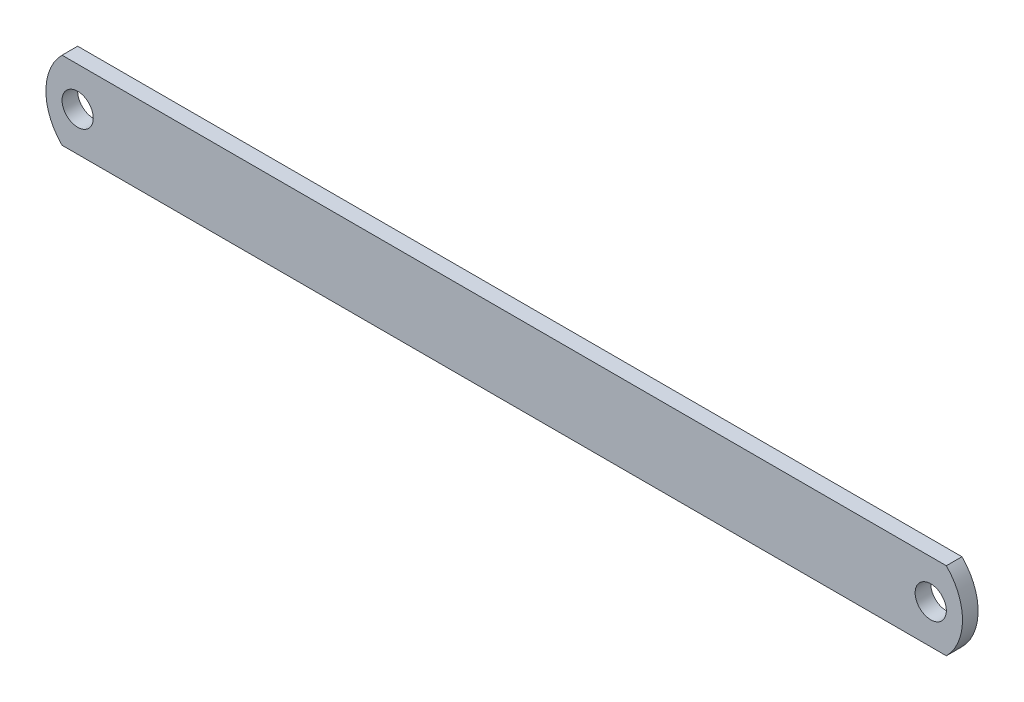
ISO-10303-21;
HEADER;
FILE_DESCRIPTION(('STEP AP214'),'2;1');
FILE_NAME('part.step','',(''),(''),'','','');
FILE_SCHEMA(('AUTOMOTIVE_DESIGN { 1 0 10303 214 1 1 1 1 }'));
ENDSEC;
DATA;
#1=APPLICATION_CONTEXT('core data for automotive mechanical design processes');
#2=APPLICATION_PROTOCOL_DEFINITION('international standard','automotive_design',2000,#1);
#3=PRODUCT_CONTEXT('',#1,'mechanical');
#4=PRODUCT('Part','Part','',(#3));
#5=PRODUCT_RELATED_PRODUCT_CATEGORY('part','',(#4));
#6=PRODUCT_DEFINITION_FORMATION('','',#4);
#7=PRODUCT_DEFINITION_CONTEXT('part definition',#1,'design');
#8=PRODUCT_DEFINITION('design','',#6,#7);
#9=PRODUCT_DEFINITION_SHAPE('','',#8);
#10=(LENGTH_UNIT() NAMED_UNIT(*) SI_UNIT(.MILLI.,.METRE.));
#11=(NAMED_UNIT(*) PLANE_ANGLE_UNIT() SI_UNIT($,.RADIAN.));
#12=(NAMED_UNIT(*) SI_UNIT($,.STERADIAN.) SOLID_ANGLE_UNIT());
#13=UNCERTAINTY_MEASURE_WITH_UNIT(LENGTH_MEASURE(1.E-05),#10,'distance_accuracy_value','');
#14=(GEOMETRIC_REPRESENTATION_CONTEXT(3) GLOBAL_UNCERTAINTY_ASSIGNED_CONTEXT((#13)) GLOBAL_UNIT_ASSIGNED_CONTEXT((#10,
#11,#12)) REPRESENTATION_CONTEXT('',''));
#15=CARTESIAN_POINT('',(0.,0.,0.));
#16=DIRECTION('',(0.,0.,1.));
#17=DIRECTION('',(1.,0.,0.));
#18=AXIS2_PLACEMENT_3D('',#15,#16,#17);
#19=CARTESIAN_POINT('',(7.50000000000006,-7.5,3.));
#20=DIRECTION('',(0.,0.,-1.));
#21=DIRECTION('',(-1.,0.,0.));
#22=AXIS2_PLACEMENT_3D('',#19,#20,#21);
#23=CYLINDRICAL_SURFACE('',#22,10.6066017177983);
#24=CARTESIAN_POINT('',(7.50000000000006,-7.5,0.));
#25=DIRECTION('',(0.,0.,1.));
#26=DIRECTION('',(1.,0.,0.));
#27=AXIS2_PLACEMENT_3D('',#24,#25,#26);
#28=CIRCLE('',#27,10.6066017177983);
#29=CARTESIAN_POINT('',(0.,0.,0.));
#30=VERTEX_POINT('',#29);
#31=CARTESIAN_POINT('',(0.,-15.,0.));
#32=VERTEX_POINT('',#31);
#33=EDGE_CURVE('E110',#30,#32,#28,.T.);
#34=ORIENTED_EDGE('',*,*,#33,.T.);
#35=DIRECTION('',(0.,0.,-1.));
#36=VECTOR('',#35,1.);
#37=CARTESIAN_POINT('',(0.,-15.,3.));
#38=LINE('',#37,#36);
#39=CARTESIAN_POINT('',(0.,-15.,3.));
#40=VERTEX_POINT('',#39);
#41=EDGE_CURVE('E13',#40,#32,#38,.T.);
#42=ORIENTED_EDGE('',*,*,#41,.F.);
#43=CARTESIAN_POINT('',(7.50000000000006,-7.5,3.));
#44=DIRECTION('',(0.,0.,1.));
#45=DIRECTION('',(1.,0.,0.));
#46=AXIS2_PLACEMENT_3D('',#43,#44,#45);
#47=CIRCLE('',#46,10.6066017177983);
#48=CARTESIAN_POINT('',(0.,0.,3.));
#49=VERTEX_POINT('',#48);
#50=EDGE_CURVE('E97',#49,#40,#47,.T.);
#51=ORIENTED_EDGE('',*,*,#50,.F.);
#52=DIRECTION('',(0.,0.,-1.));
#53=VECTOR('',#52,1.);
#54=CARTESIAN_POINT('',(0.,0.,3.));
#55=LINE('',#54,#53);
#56=EDGE_CURVE('E106',#49,#30,#55,.T.);
#57=ORIENTED_EDGE('',*,*,#56,.T.);
#58=EDGE_LOOP('',(#34,#42,#51,#57));
#59=FACE_BOUND('',#58,.T.);
#60=ADVANCED_FACE('F44',(#59),#23,.T.);
#61=CARTESIAN_POINT('',(0.,-15.,3.));
#62=DIRECTION('',(0.,1.,0.));
#63=DIRECTION('',(0.,0.,1.));
#64=AXIS2_PLACEMENT_3D('',#61,#62,#63);
#65=PLANE('',#64);
#66=DIRECTION('',(1.,0.,0.));
#67=VECTOR('',#66,1.);
#68=CARTESIAN_POINT('',(0.,-15.,0.));
#69=LINE('',#68,#67);
#70=CARTESIAN_POINT('',(170.,-15.,0.));
#71=VERTEX_POINT('',#70);
#72=EDGE_CURVE('E101',#32,#71,#69,.T.);
#73=ORIENTED_EDGE('',*,*,#72,.T.);
#74=DIRECTION('',(0.,0.,-1.));
#75=VECTOR('',#74,1.);
#76=CARTESIAN_POINT('',(170.,-15.,3.));
#77=LINE('',#76,#75);
#78=CARTESIAN_POINT('',(170.,-15.,3.));
#79=VERTEX_POINT('',#78);
#80=EDGE_CURVE('E53',#79,#71,#77,.T.);
#81=ORIENTED_EDGE('',*,*,#80,.F.);
#82=DIRECTION('',(1.,0.,0.));
#83=VECTOR('',#82,1.);
#84=CARTESIAN_POINT('',(0.,-15.,3.));
#85=LINE('',#84,#83);
#86=EDGE_CURVE('E92',#40,#79,#85,.T.);
#87=ORIENTED_EDGE('',*,*,#86,.F.);
#88=ORIENTED_EDGE('',*,*,#41,.T.);
#89=EDGE_LOOP('',(#73,#81,#87,#88));
#90=FACE_BOUND('',#89,.T.);
#91=ADVANCED_FACE('F100',(#90),#65,.F.);
#92=CARTESIAN_POINT('',(162.5,-7.5,3.));
#93=DIRECTION('',(0.,0.,-1.));
#94=DIRECTION('',(-1.,0.,0.));
#95=AXIS2_PLACEMENT_3D('',#92,#93,#94);
#96=CYLINDRICAL_SURFACE('',#95,10.6066017177983);
#97=CARTESIAN_POINT('',(162.5,-7.5,0.));
#98=DIRECTION('',(0.,0.,1.));
#99=DIRECTION('',(-1.,0.,0.));
#100=AXIS2_PLACEMENT_3D('',#97,#98,#99);
#101=CIRCLE('',#100,10.6066017177983);
#102=CARTESIAN_POINT('',(170.,0.,0.));
#103=VERTEX_POINT('',#102);
#104=EDGE_CURVE('E79',#71,#103,#101,.T.);
#105=ORIENTED_EDGE('',*,*,#104,.T.);
#106=DIRECTION('',(0.,0.,-1.));
#107=VECTOR('',#106,1.);
#108=CARTESIAN_POINT('',(170.,0.,3.));
#109=LINE('',#108,#107);
#110=CARTESIAN_POINT('',(170.,0.,3.));
#111=VERTEX_POINT('',#110);
#112=EDGE_CURVE('E102',#111,#103,#109,.T.);
#113=ORIENTED_EDGE('',*,*,#112,.F.);
#114=CARTESIAN_POINT('',(162.5,-7.5,3.));
#115=DIRECTION('',(0.,0.,1.));
#116=DIRECTION('',(-1.,0.,0.));
#117=AXIS2_PLACEMENT_3D('',#114,#115,#116);
#118=CIRCLE('',#117,10.6066017177983);
#119=EDGE_CURVE('E95',#79,#111,#118,.T.);
#120=ORIENTED_EDGE('',*,*,#119,.F.);
#121=ORIENTED_EDGE('',*,*,#80,.T.);
#122=EDGE_LOOP('',(#105,#113,#120,#121));
#123=FACE_BOUND('',#122,.T.);
#124=ADVANCED_FACE('F104',(#123),#96,.T.);
#125=CARTESIAN_POINT('',(0.,0.,3.));
#126=DIRECTION('',(0.,-1.,0.));
#127=DIRECTION('',(0.,0.,-1.));
#128=AXIS2_PLACEMENT_3D('',#125,#126,#127);
#129=PLANE('',#128);
#130=DIRECTION('',(-1.,0.,0.));
#131=VECTOR('',#130,1.);
#132=CARTESIAN_POINT('',(0.,0.,0.));
#133=LINE('',#132,#131);
#134=EDGE_CURVE('E85',#103,#30,#133,.T.);
#135=ORIENTED_EDGE('',*,*,#134,.T.);
#136=ORIENTED_EDGE('',*,*,#56,.F.);
#137=DIRECTION('',(-1.,0.,0.));
#138=VECTOR('',#137,1.);
#139=CARTESIAN_POINT('',(0.,0.,3.));
#140=LINE('',#139,#138);
#141=EDGE_CURVE('E62',#111,#49,#140,.T.);
#142=ORIENTED_EDGE('',*,*,#141,.F.);
#143=ORIENTED_EDGE('',*,*,#112,.T.);
#144=EDGE_LOOP('',(#135,#136,#142,#143));
#145=FACE_BOUND('',#144,.T.);
#146=ADVANCED_FACE('F138',(#145),#129,.F.);
#147=CARTESIAN_POINT('',(7.50000000000006,-7.5,3.));
#148=DIRECTION('',(0.,0.,1.));
#149=DIRECTION('',(1.,0.,0.));
#150=AXIS2_PLACEMENT_3D('',#147,#148,#149);
#151=PLANE('',#150);
#152=CARTESIAN_POINT('',(167.,-7.5,3.));
#153=DIRECTION('',(0.,0.,1.));
#154=DIRECTION('',(1.,0.,0.));
#155=AXIS2_PLACEMENT_3D('',#152,#153,#154);
#156=CIRCLE('',#155,2.99999999999999);
#157=CARTESIAN_POINT('',(170.,-7.5,3.));
#158=VERTEX_POINT('',#157);
#159=EDGE_CURVE('E127',#158,#158,#156,.T.);
#160=ORIENTED_EDGE('',*,*,#159,.F.);
#161=EDGE_LOOP('',(#160));
#162=FACE_BOUND('',#161,.T.);
#163=CARTESIAN_POINT('',(3.,-7.5,3.));
#164=DIRECTION('',(0.,0.,1.));
#165=DIRECTION('',(1.,0.,0.));
#166=AXIS2_PLACEMENT_3D('',#163,#164,#165);
#167=CIRCLE('',#166,3.);
#168=CARTESIAN_POINT('',(6.,-7.5,3.));
#169=VERTEX_POINT('',#168);
#170=EDGE_CURVE('E119',#169,#169,#167,.T.);
#171=ORIENTED_EDGE('',*,*,#170,.F.);
#172=EDGE_LOOP('',(#171));
#173=FACE_BOUND('',#172,.T.);
#174=ORIENTED_EDGE('',*,*,#50,.T.);
#175=ORIENTED_EDGE('',*,*,#86,.T.);
#176=ORIENTED_EDGE('',*,*,#119,.T.);
#177=ORIENTED_EDGE('',*,*,#141,.T.);
#178=EDGE_LOOP('',(#174,#175,#176,#177));
#179=FACE_BOUND('',#178,.T.);
#180=ADVANCED_FACE('F93',(#162,#173,#179),#151,.T.);
#181=CARTESIAN_POINT('',(7.50000000000006,-7.5,0.));
#182=DIRECTION('',(0.,0.,1.));
#183=DIRECTION('',(1.,0.,0.));
#184=AXIS2_PLACEMENT_3D('',#181,#182,#183);
#185=PLANE('',#184);
#186=CARTESIAN_POINT('',(167.,-7.5,0.));
#187=DIRECTION('',(0.,0.,1.));
#188=DIRECTION('',(1.,0.,0.));
#189=AXIS2_PLACEMENT_3D('',#186,#187,#188);
#190=CIRCLE('',#189,2.99999999999999);
#191=CARTESIAN_POINT('',(170.,-7.5,0.));
#192=VERTEX_POINT('',#191);
#193=EDGE_CURVE('E47',#192,#192,#190,.T.);
#194=ORIENTED_EDGE('',*,*,#193,.T.);
#195=EDGE_LOOP('',(#194));
#196=FACE_BOUND('',#195,.T.);
#197=CARTESIAN_POINT('',(3.,-7.5,0.));
#198=DIRECTION('',(0.,0.,1.));
#199=DIRECTION('',(1.,0.,0.));
#200=AXIS2_PLACEMENT_3D('',#197,#198,#199);
#201=CIRCLE('',#200,3.);
#202=CARTESIAN_POINT('',(6.,-7.5,0.));
#203=VERTEX_POINT('',#202);
#204=EDGE_CURVE('E113',#203,#203,#201,.T.);
#205=ORIENTED_EDGE('',*,*,#204,.T.);
#206=EDGE_LOOP('',(#205));
#207=FACE_BOUND('',#206,.T.);
#208=ORIENTED_EDGE('',*,*,#33,.F.);
#209=ORIENTED_EDGE('',*,*,#134,.F.);
#210=ORIENTED_EDGE('',*,*,#104,.F.);
#211=ORIENTED_EDGE('',*,*,#72,.F.);
#212=EDGE_LOOP('',(#208,#209,#210,#211));
#213=FACE_BOUND('',#212,.T.);
#214=ADVANCED_FACE('F137',(#196,#207,#213),#185,.F.);
#215=CARTESIAN_POINT('',(3.,-7.5,-7.));
#216=DIRECTION('',(0.,0.,1.));
#217=DIRECTION('',(1.,0.,0.));
#218=AXIS2_PLACEMENT_3D('',#215,#216,#217);
#219=CYLINDRICAL_SURFACE('',#218,3.);
#220=ORIENTED_EDGE('',*,*,#170,.T.);
#221=EDGE_LOOP('',(#220));
#222=FACE_BOUND('',#221,.T.);
#223=ORIENTED_EDGE('',*,*,#204,.F.);
#224=EDGE_LOOP('',(#223));
#225=FACE_BOUND('',#224,.T.);
#226=ADVANCED_FACE('F144',(#222,#225),#219,.F.);
#227=CARTESIAN_POINT('',(167.,-7.5,-7.));
#228=DIRECTION('',(0.,0.,1.));
#229=DIRECTION('',(1.,0.,0.));
#230=AXIS2_PLACEMENT_3D('',#227,#228,#229);
#231=CYLINDRICAL_SURFACE('',#230,2.99999999999999);
#232=ORIENTED_EDGE('',*,*,#159,.T.);
#233=EDGE_LOOP('',(#232));
#234=FACE_BOUND('',#233,.T.);
#235=ORIENTED_EDGE('',*,*,#193,.F.);
#236=EDGE_LOOP('',(#235));
#237=FACE_BOUND('',#236,.T.);
#238=ADVANCED_FACE('F132',(#234,#237),#231,.F.);
#239=CLOSED_SHELL('',(#60,#91,#124,#146,#180,#214,#226,#238));
#240=MANIFOLD_SOLID_BREP('B2',#239);
#241=ADVANCED_BREP_SHAPE_REPRESENTATION('',(#18,#240),#14);
#242=SHAPE_DEFINITION_REPRESENTATION(#9,#241);
ENDSEC;
END-ISO-10303-21;
